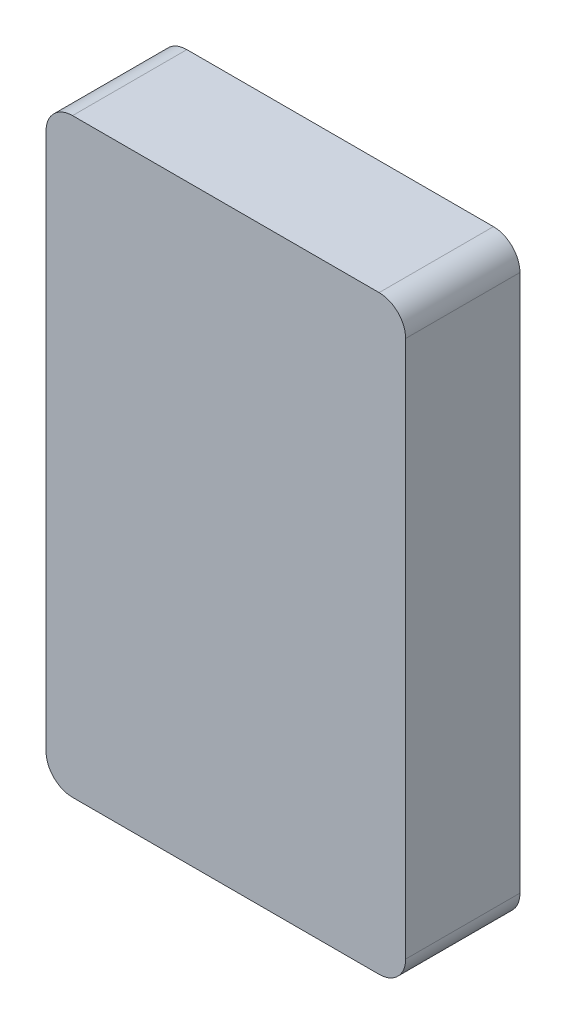
ISO-10303-21;
HEADER;
FILE_DESCRIPTION(('STEP AP214'),'2;1');
FILE_NAME('part.step','',(''),(''),'','','');
FILE_SCHEMA(('AUTOMOTIVE_DESIGN { 1 0 10303 214 1 1 1 1 }'));
ENDSEC;
DATA;
#1=APPLICATION_CONTEXT('core data for automotive mechanical design processes');
#2=APPLICATION_PROTOCOL_DEFINITION('international standard','automotive_design',2000,#1);
#3=PRODUCT_CONTEXT('',#1,'mechanical');
#4=PRODUCT('Part','Part','',(#3));
#5=PRODUCT_RELATED_PRODUCT_CATEGORY('part','',(#4));
#6=PRODUCT_DEFINITION_FORMATION('','',#4);
#7=PRODUCT_DEFINITION_CONTEXT('part definition',#1,'design');
#8=PRODUCT_DEFINITION('design','',#6,#7);
#9=PRODUCT_DEFINITION_SHAPE('','',#8);
#10=(LENGTH_UNIT() NAMED_UNIT(*) SI_UNIT(.MILLI.,.METRE.));
#11=(NAMED_UNIT(*) PLANE_ANGLE_UNIT() SI_UNIT($,.RADIAN.));
#12=(NAMED_UNIT(*) SI_UNIT($,.STERADIAN.) SOLID_ANGLE_UNIT());
#13=UNCERTAINTY_MEASURE_WITH_UNIT(LENGTH_MEASURE(1.E-05),#10,'distance_accuracy_value','');
#14=(GEOMETRIC_REPRESENTATION_CONTEXT(3) GLOBAL_UNCERTAINTY_ASSIGNED_CONTEXT((#13)) GLOBAL_UNIT_ASSIGNED_CONTEXT((#10,
#11,#12)) REPRESENTATION_CONTEXT('',''));
#15=CARTESIAN_POINT('',(0.,0.,0.));
#16=DIRECTION('',(0.,0.,1.));
#17=DIRECTION('',(1.,0.,0.));
#18=AXIS2_PLACEMENT_3D('',#15,#16,#17);
#19=CARTESIAN_POINT('',(-400.,-5.,0.));
#20=DIRECTION('',(0.,0.,1.));
#21=DIRECTION('',(1.,0.,0.));
#22=AXIS2_PLACEMENT_3D('',#19,#20,#21);
#23=PLANE('',#22);
#24=CARTESIAN_POINT('',(-400.,-5.,0.));
#25=DIRECTION('',(0.,0.,1.));
#26=DIRECTION('',(1.,0.,0.));
#27=AXIS2_PLACEMENT_3D('',#24,#25,#26);
#28=CIRCLE('',#27,35.);
#29=CARTESIAN_POINT('',(-435.,-5.00000000000001,0.));
#30=VERTEX_POINT('',#29);
#31=CARTESIAN_POINT('',(-400.,-40.,0.));
#32=VERTEX_POINT('',#31);
#33=EDGE_CURVE('E195',#30,#32,#28,.T.);
#34=ORIENTED_EDGE('',*,*,#33,.F.);
#35=DIRECTION('',(0.,-1.,0.));
#36=VECTOR('',#35,1.);
#37=CARTESIAN_POINT('',(-435.,705.,0.));
#38=LINE('',#37,#36);
#39=CARTESIAN_POINT('',(-435.,705.,0.));
#40=VERTEX_POINT('',#39);
#41=EDGE_CURVE('E55',#40,#30,#38,.T.);
#42=ORIENTED_EDGE('',*,*,#41,.F.);
#43=CARTESIAN_POINT('',(-400.,705.,0.));
#44=DIRECTION('',(0.,0.,1.));
#45=DIRECTION('',(1.,0.,0.));
#46=AXIS2_PLACEMENT_3D('',#43,#44,#45);
#47=CIRCLE('',#46,35.0000000000001);
#48=CARTESIAN_POINT('',(-400.,740.,0.));
#49=VERTEX_POINT('',#48);
#50=EDGE_CURVE('E207',#49,#40,#47,.T.);
#51=ORIENTED_EDGE('',*,*,#50,.F.);
#52=DIRECTION('',(-1.,0.,0.));
#53=VECTOR('',#52,1.);
#54=CARTESIAN_POINT('',(-400.,740.,0.));
#55=LINE('',#54,#53);
#56=CARTESIAN_POINT('',(5.,740.,0.));
#57=VERTEX_POINT('',#56);
#58=EDGE_CURVE('E205',#57,#49,#55,.T.);
#59=ORIENTED_EDGE('',*,*,#58,.F.);
#60=CARTESIAN_POINT('',(5.,705.,0.));
#61=DIRECTION('',(0.,0.,1.));
#62=DIRECTION('',(-1.,0.,0.));
#63=AXIS2_PLACEMENT_3D('',#60,#61,#62);
#64=CIRCLE('',#63,35.0000000000001);
#65=CARTESIAN_POINT('',(40.0000000000001,705.,0.));
#66=VERTEX_POINT('',#65);
#67=EDGE_CURVE('E203',#66,#57,#64,.T.);
#68=ORIENTED_EDGE('',*,*,#67,.F.);
#69=DIRECTION('',(0.,1.,0.));
#70=VECTOR('',#69,1.);
#71=CARTESIAN_POINT('',(40.,705.,0.));
#72=LINE('',#71,#70);
#73=CARTESIAN_POINT('',(40.0000000000001,-5.00000000000005,0.));
#74=VERTEX_POINT('',#73);
#75=EDGE_CURVE('E201',#74,#66,#72,.T.);
#76=ORIENTED_EDGE('',*,*,#75,.F.);
#77=CARTESIAN_POINT('',(5.00000000000012,-5.00000000000005,0.));
#78=DIRECTION('',(0.,0.,1.));
#79=DIRECTION('',(1.,0.,0.));
#80=AXIS2_PLACEMENT_3D('',#77,#78,#79);
#81=CIRCLE('',#80,35.);
#82=CARTESIAN_POINT('',(5.00000000000011,-40.,0.));
#83=VERTEX_POINT('',#82);
#84=EDGE_CURVE('E131',#83,#74,#81,.T.);
#85=ORIENTED_EDGE('',*,*,#84,.F.);
#86=DIRECTION('',(1.,0.,0.));
#87=VECTOR('',#86,1.);
#88=CARTESIAN_POINT('',(-400.,-40.,0.));
#89=LINE('',#88,#87);
#90=EDGE_CURVE('E198',#32,#83,#89,.T.);
#91=ORIENTED_EDGE('',*,*,#90,.F.);
#92=EDGE_LOOP('',(#34,#42,#51,#59,#68,#76,#85,#91));
#93=FACE_BOUND('',#92,.T.);
#94=DIRECTION('',(0.,1.,0.));
#95=VECTOR('',#94,1.);
#96=CARTESIAN_POINT('',(0.,0.,0.));
#97=LINE('',#96,#95);
#98=CARTESIAN_POINT('',(0.,0.,0.));
#99=VERTEX_POINT('',#98);
#100=CARTESIAN_POINT('',(0.,700.,0.));
#101=VERTEX_POINT('',#100);
#102=EDGE_CURVE('E47',#99,#101,#97,.T.);
#103=ORIENTED_EDGE('',*,*,#102,.T.);
#104=DIRECTION('',(-1.,0.,0.));
#105=VECTOR('',#104,1.);
#106=CARTESIAN_POINT('',(0.,700.,0.));
#107=LINE('',#106,#105);
#108=CARTESIAN_POINT('',(-395.,700.,0.));
#109=VERTEX_POINT('',#108);
#110=EDGE_CURVE('E180',#101,#109,#107,.T.);
#111=ORIENTED_EDGE('',*,*,#110,.T.);
#112=DIRECTION('',(0.,-1.,0.));
#113=VECTOR('',#112,1.);
#114=CARTESIAN_POINT('',(-395.,0.,0.));
#115=LINE('',#114,#113);
#116=CARTESIAN_POINT('',(-395.,0.,0.));
#117=VERTEX_POINT('',#116);
#118=EDGE_CURVE('E183',#109,#117,#115,.T.);
#119=ORIENTED_EDGE('',*,*,#118,.T.);
#120=DIRECTION('',(1.,0.,0.));
#121=VECTOR('',#120,1.);
#122=CARTESIAN_POINT('',(0.,0.,0.));
#123=LINE('',#122,#121);
#124=EDGE_CURVE('E169',#117,#99,#123,.T.);
#125=ORIENTED_EDGE('',*,*,#124,.T.);
#126=EDGE_LOOP('',(#103,#111,#119,#125));
#127=FACE_BOUND('',#126,.T.);
#128=ADVANCED_FACE('F32',(#93,#127),#23,.F.);
#129=CARTESIAN_POINT('',(-400.,-5.,150.));
#130=DIRECTION('',(0.,0.,-1.));
#131=DIRECTION('',(-1.,0.,0.));
#132=AXIS2_PLACEMENT_3D('',#129,#130,#131);
#133=CYLINDRICAL_SURFACE('',#132,35.);
#134=ORIENTED_EDGE('',*,*,#33,.T.);
#135=DIRECTION('',(0.,0.,-1.));
#136=VECTOR('',#135,1.);
#137=CARTESIAN_POINT('',(-400.,-40.,150.));
#138=LINE('',#137,#136);
#139=CARTESIAN_POINT('',(-400.,-40.,151.));
#140=VERTEX_POINT('',#139);
#141=EDGE_CURVE('E11',#140,#32,#138,.T.);
#142=ORIENTED_EDGE('',*,*,#141,.F.);
#143=CARTESIAN_POINT('',(-400.,-5.,151.));
#144=DIRECTION('',(0.,0.,1.));
#145=DIRECTION('',(1.,0.,0.));
#146=AXIS2_PLACEMENT_3D('',#143,#144,#145);
#147=CIRCLE('',#146,35.);
#148=CARTESIAN_POINT('',(-435.,-5.,151.));
#149=VERTEX_POINT('',#148);
#150=EDGE_CURVE('E162',#149,#140,#147,.T.);
#151=ORIENTED_EDGE('',*,*,#150,.F.);
#152=DIRECTION('',(0.,0.,-1.));
#153=VECTOR('',#152,1.);
#154=CARTESIAN_POINT('',(-435.,-5.00000000000001,150.));
#155=LINE('',#154,#153);
#156=EDGE_CURVE('E210',#149,#30,#155,.T.);
#157=ORIENTED_EDGE('',*,*,#156,.T.);
#158=EDGE_LOOP('',(#134,#142,#151,#157));
#159=FACE_BOUND('',#158,.T.);
#160=ADVANCED_FACE('F34',(#159),#133,.T.);
#161=CARTESIAN_POINT('',(-400.,-40.,150.));
#162=DIRECTION('',(0.,1.,0.));
#163=DIRECTION('',(-1.,0.,0.));
#164=AXIS2_PLACEMENT_3D('',#161,#162,#163);
#165=PLANE('',#164);
#166=ORIENTED_EDGE('',*,*,#90,.T.);
#167=DIRECTION('',(0.,0.,-1.));
#168=VECTOR('',#167,1.);
#169=CARTESIAN_POINT('',(5.00000000000011,-40.,150.));
#170=LINE('',#169,#168);
#171=CARTESIAN_POINT('',(5.00000000000011,-40.,151.));
#172=VERTEX_POINT('',#171);
#173=EDGE_CURVE('E40',#172,#83,#170,.T.);
#174=ORIENTED_EDGE('',*,*,#173,.F.);
#175=DIRECTION('',(1.,0.,0.));
#176=VECTOR('',#175,1.);
#177=CARTESIAN_POINT('',(-400.,-40.,151.));
#178=LINE('',#177,#176);
#179=EDGE_CURVE('E149',#140,#172,#178,.T.);
#180=ORIENTED_EDGE('',*,*,#179,.F.);
#181=ORIENTED_EDGE('',*,*,#141,.T.);
#182=EDGE_LOOP('',(#166,#174,#180,#181));
#183=FACE_BOUND('',#182,.T.);
#184=ADVANCED_FACE('F239',(#183),#165,.F.);
#185=CARTESIAN_POINT('',(5.00000000000012,-5.00000000000005,150.));
#186=DIRECTION('',(0.,0.,-1.));
#187=DIRECTION('',(-1.,0.,0.));
#188=AXIS2_PLACEMENT_3D('',#185,#186,#187);
#189=CYLINDRICAL_SURFACE('',#188,35.);
#190=ORIENTED_EDGE('',*,*,#84,.T.);
#191=DIRECTION('',(0.,0.,-1.));
#192=VECTOR('',#191,1.);
#193=CARTESIAN_POINT('',(40.0000000000001,-5.00000000000005,150.));
#194=LINE('',#193,#192);
#195=CARTESIAN_POINT('',(40.0000000000001,-5.00000000000005,151.));
#196=VERTEX_POINT('',#195);
#197=EDGE_CURVE('E124',#196,#74,#194,.T.);
#198=ORIENTED_EDGE('',*,*,#197,.F.);
#199=CARTESIAN_POINT('',(5.00000000000012,-5.00000000000005,151.));
#200=DIRECTION('',(0.,0.,1.));
#201=DIRECTION('',(1.,0.,0.));
#202=AXIS2_PLACEMENT_3D('',#199,#200,#201);
#203=CIRCLE('',#202,35.);
#204=EDGE_CURVE('E129',#172,#196,#203,.T.);
#205=ORIENTED_EDGE('',*,*,#204,.F.);
#206=ORIENTED_EDGE('',*,*,#173,.T.);
#207=EDGE_LOOP('',(#190,#198,#205,#206));
#208=FACE_BOUND('',#207,.T.);
#209=ADVANCED_FACE('F126',(#208),#189,.T.);
#210=CARTESIAN_POINT('',(40.,705.,150.));
#211=DIRECTION('',(-1.,0.,0.));
#212=DIRECTION('',(0.,-1.,0.));
#213=AXIS2_PLACEMENT_3D('',#210,#211,#212);
#214=PLANE('',#213);
#215=ORIENTED_EDGE('',*,*,#75,.T.);
#216=DIRECTION('',(0.,0.,-1.));
#217=VECTOR('',#216,1.);
#218=CARTESIAN_POINT('',(40.0000000000001,705.,150.));
#219=LINE('',#218,#217);
#220=CARTESIAN_POINT('',(40.0000000000001,705.,151.));
#221=VERTEX_POINT('',#220);
#222=EDGE_CURVE('E134',#221,#66,#219,.T.);
#223=ORIENTED_EDGE('',*,*,#222,.F.);
#224=DIRECTION('',(0.,1.,0.));
#225=VECTOR('',#224,1.);
#226=CARTESIAN_POINT('',(40.0000000000001,-5.00000000000005,151.));
#227=LINE('',#226,#225);
#228=EDGE_CURVE('E137',#196,#221,#227,.T.);
#229=ORIENTED_EDGE('',*,*,#228,.F.);
#230=ORIENTED_EDGE('',*,*,#197,.T.);
#231=EDGE_LOOP('',(#215,#223,#229,#230));
#232=FACE_BOUND('',#231,.T.);
#233=ADVANCED_FACE('F138',(#232),#214,.F.);
#234=CARTESIAN_POINT('',(5.,705.,150.));
#235=DIRECTION('',(0.,0.,-1.));
#236=DIRECTION('',(-1.,0.,0.));
#237=AXIS2_PLACEMENT_3D('',#234,#235,#236);
#238=CYLINDRICAL_SURFACE('',#237,35.0000000000001);
#239=ORIENTED_EDGE('',*,*,#67,.T.);
#240=DIRECTION('',(0.,0.,-1.));
#241=VECTOR('',#240,1.);
#242=CARTESIAN_POINT('',(5.,740.,150.));
#243=LINE('',#242,#241);
#244=CARTESIAN_POINT('',(5.,740.,151.));
#245=VERTEX_POINT('',#244);
#246=EDGE_CURVE('E217',#245,#57,#243,.T.);
#247=ORIENTED_EDGE('',*,*,#246,.F.);
#248=CARTESIAN_POINT('',(5.,705.,151.));
#249=DIRECTION('',(0.,0.,1.));
#250=DIRECTION('',(1.,0.,0.));
#251=AXIS2_PLACEMENT_3D('',#248,#249,#250);
#252=CIRCLE('',#251,35.0000000000001);
#253=EDGE_CURVE('E143',#221,#245,#252,.T.);
#254=ORIENTED_EDGE('',*,*,#253,.F.);
#255=ORIENTED_EDGE('',*,*,#222,.T.);
#256=EDGE_LOOP('',(#239,#247,#254,#255));
#257=FACE_BOUND('',#256,.T.);
#258=ADVANCED_FACE('F227',(#257),#238,.T.);
#259=CARTESIAN_POINT('',(-400.,740.,150.));
#260=DIRECTION('',(0.,-1.,0.));
#261=DIRECTION('',(0.,0.,-1.));
#262=AXIS2_PLACEMENT_3D('',#259,#260,#261);
#263=PLANE('',#262);
#264=ORIENTED_EDGE('',*,*,#58,.T.);
#265=DIRECTION('',(0.,0.,-1.));
#266=VECTOR('',#265,1.);
#267=CARTESIAN_POINT('',(-400.,740.,150.));
#268=LINE('',#267,#266);
#269=CARTESIAN_POINT('',(-400.,740.,151.));
#270=VERTEX_POINT('',#269);
#271=EDGE_CURVE('E214',#270,#49,#268,.T.);
#272=ORIENTED_EDGE('',*,*,#271,.F.);
#273=DIRECTION('',(-1.,0.,0.));
#274=VECTOR('',#273,1.);
#275=CARTESIAN_POINT('',(5.,740.,151.));
#276=LINE('',#275,#274);
#277=EDGE_CURVE('E153',#245,#270,#276,.T.);
#278=ORIENTED_EDGE('',*,*,#277,.F.);
#279=ORIENTED_EDGE('',*,*,#246,.T.);
#280=EDGE_LOOP('',(#264,#272,#278,#279));
#281=FACE_BOUND('',#280,.T.);
#282=ADVANCED_FACE('F231',(#281),#263,.F.);
#283=CARTESIAN_POINT('',(-400.,705.,150.));
#284=DIRECTION('',(0.,0.,-1.));
#285=DIRECTION('',(-1.,0.,0.));
#286=AXIS2_PLACEMENT_3D('',#283,#284,#285);
#287=CYLINDRICAL_SURFACE('',#286,35.0000000000001);
#288=ORIENTED_EDGE('',*,*,#50,.T.);
#289=DIRECTION('',(0.,0.,-1.));
#290=VECTOR('',#289,1.);
#291=CARTESIAN_POINT('',(-435.,705.,150.));
#292=LINE('',#291,#290);
#293=CARTESIAN_POINT('',(-435.,705.,151.));
#294=VERTEX_POINT('',#293);
#295=EDGE_CURVE('E212',#294,#40,#292,.T.);
#296=ORIENTED_EDGE('',*,*,#295,.F.);
#297=CARTESIAN_POINT('',(-400.,705.,151.));
#298=DIRECTION('',(0.,0.,1.));
#299=DIRECTION('',(1.,0.,0.));
#300=AXIS2_PLACEMENT_3D('',#297,#298,#299);
#301=CIRCLE('',#300,35.);
#302=EDGE_CURVE('E156',#270,#294,#301,.T.);
#303=ORIENTED_EDGE('',*,*,#302,.F.);
#304=ORIENTED_EDGE('',*,*,#271,.T.);
#305=EDGE_LOOP('',(#288,#296,#303,#304));
#306=FACE_BOUND('',#305,.T.);
#307=ADVANCED_FACE('F234',(#306),#287,.T.);
#308=CARTESIAN_POINT('',(-435.,705.,150.));
#309=DIRECTION('',(1.,0.,0.));
#310=DIRECTION('',(0.,1.,0.));
#311=AXIS2_PLACEMENT_3D('',#308,#309,#310);
#312=PLANE('',#311);
#313=ORIENTED_EDGE('',*,*,#41,.T.);
#314=ORIENTED_EDGE('',*,*,#156,.F.);
#315=DIRECTION('',(0.,-1.,0.));
#316=VECTOR('',#315,1.);
#317=CARTESIAN_POINT('',(-435.,705.,151.));
#318=LINE('',#317,#316);
#319=EDGE_CURVE('E159',#294,#149,#318,.T.);
#320=ORIENTED_EDGE('',*,*,#319,.F.);
#321=ORIENTED_EDGE('',*,*,#295,.T.);
#322=EDGE_LOOP('',(#313,#314,#320,#321));
#323=FACE_BOUND('',#322,.T.);
#324=ADVANCED_FACE('F238',(#323),#312,.F.);
#325=CARTESIAN_POINT('',(0.,0.,150.));
#326=DIRECTION('',(-1.,0.,0.));
#327=DIRECTION('',(0.,0.,1.));
#328=AXIS2_PLACEMENT_3D('',#325,#326,#327);
#329=PLANE('',#328);
#330=ORIENTED_EDGE('',*,*,#102,.F.);
#331=DIRECTION('',(0.,0.,-1.));
#332=VECTOR('',#331,1.);
#333=CARTESIAN_POINT('',(0.,0.,150.));
#334=LINE('',#333,#332);
#335=CARTESIAN_POINT('',(0.,0.,150.));
#336=VERTEX_POINT('',#335);
#337=EDGE_CURVE('E178',#336,#99,#334,.T.);
#338=ORIENTED_EDGE('',*,*,#337,.F.);
#339=DIRECTION('',(0.,1.,0.));
#340=VECTOR('',#339,1.);
#341=CARTESIAN_POINT('',(0.,0.,150.));
#342=LINE('',#341,#340);
#343=CARTESIAN_POINT('',(0.,700.,150.));
#344=VERTEX_POINT('',#343);
#345=EDGE_CURVE('E165',#336,#344,#342,.T.);
#346=ORIENTED_EDGE('',*,*,#345,.T.);
#347=DIRECTION('',(0.,0.,-1.));
#348=VECTOR('',#347,1.);
#349=CARTESIAN_POINT('',(0.,700.,150.));
#350=LINE('',#349,#348);
#351=EDGE_CURVE('E193',#344,#101,#350,.T.);
#352=ORIENTED_EDGE('',*,*,#351,.T.);
#353=EDGE_LOOP('',(#330,#338,#346,#352));
#354=FACE_BOUND('',#353,.T.);
#355=ADVANCED_FACE('F252',(#354),#329,.T.);
#356=CARTESIAN_POINT('',(0.,700.,150.));
#357=DIRECTION('',(0.,-1.,0.));
#358=DIRECTION('',(0.,0.,-1.));
#359=AXIS2_PLACEMENT_3D('',#356,#357,#358);
#360=PLANE('',#359);
#361=ORIENTED_EDGE('',*,*,#110,.F.);
#362=ORIENTED_EDGE('',*,*,#351,.F.);
#363=DIRECTION('',(-1.,0.,0.));
#364=VECTOR('',#363,1.);
#365=CARTESIAN_POINT('',(0.,700.,150.));
#366=LINE('',#365,#364);
#367=CARTESIAN_POINT('',(-395.,700.,150.));
#368=VERTEX_POINT('',#367);
#369=EDGE_CURVE('E168',#344,#368,#366,.T.);
#370=ORIENTED_EDGE('',*,*,#369,.T.);
#371=DIRECTION('',(0.,0.,-1.));
#372=VECTOR('',#371,1.);
#373=CARTESIAN_POINT('',(-395.,700.,150.));
#374=LINE('',#373,#372);
#375=EDGE_CURVE('E191',#368,#109,#374,.T.);
#376=ORIENTED_EDGE('',*,*,#375,.T.);
#377=EDGE_LOOP('',(#361,#362,#370,#376));
#378=FACE_BOUND('',#377,.T.);
#379=ADVANCED_FACE('F289',(#378),#360,.T.);
#380=CARTESIAN_POINT('',(-395.,0.,150.));
#381=DIRECTION('',(1.,0.,0.));
#382=DIRECTION('',(0.,0.,-1.));
#383=AXIS2_PLACEMENT_3D('',#380,#381,#382);
#384=PLANE('',#383);
#385=ORIENTED_EDGE('',*,*,#118,.F.);
#386=ORIENTED_EDGE('',*,*,#375,.F.);
#387=DIRECTION('',(0.,-1.,0.));
#388=VECTOR('',#387,1.);
#389=CARTESIAN_POINT('',(-395.,0.,150.));
#390=LINE('',#389,#388);
#391=CARTESIAN_POINT('',(-395.,0.,150.));
#392=VERTEX_POINT('',#391);
#393=EDGE_CURVE('E172',#368,#392,#390,.T.);
#394=ORIENTED_EDGE('',*,*,#393,.T.);
#395=DIRECTION('',(0.,0.,-1.));
#396=VECTOR('',#395,1.);
#397=CARTESIAN_POINT('',(-395.,0.,150.));
#398=LINE('',#397,#396);
#399=EDGE_CURVE('E189',#392,#117,#398,.T.);
#400=ORIENTED_EDGE('',*,*,#399,.T.);
#401=EDGE_LOOP('',(#385,#386,#394,#400));
#402=FACE_BOUND('',#401,.T.);
#403=ADVANCED_FACE('F295',(#402),#384,.T.);
#404=CARTESIAN_POINT('',(0.,0.,150.));
#405=DIRECTION('',(0.,1.,0.));
#406=DIRECTION('',(0.,0.,1.));
#407=AXIS2_PLACEMENT_3D('',#404,#405,#406);
#408=PLANE('',#407);
#409=ORIENTED_EDGE('',*,*,#124,.F.);
#410=ORIENTED_EDGE('',*,*,#399,.F.);
#411=DIRECTION('',(1.,0.,0.));
#412=VECTOR('',#411,1.);
#413=CARTESIAN_POINT('',(0.,0.,150.));
#414=LINE('',#413,#412);
#415=EDGE_CURVE('E175',#392,#336,#414,.T.);
#416=ORIENTED_EDGE('',*,*,#415,.T.);
#417=ORIENTED_EDGE('',*,*,#337,.T.);
#418=EDGE_LOOP('',(#409,#410,#416,#417));
#419=FACE_BOUND('',#418,.T.);
#420=ADVANCED_FACE('F302',(#419),#408,.T.);
#421=CARTESIAN_POINT('',(5.00000000000012,-5.00000000000005,150.));
#422=DIRECTION('',(0.,0.,1.));
#423=DIRECTION('',(1.,0.,0.));
#424=AXIS2_PLACEMENT_3D('',#421,#422,#423);
#425=PLANE('',#424);
#426=ORIENTED_EDGE('',*,*,#345,.F.);
#427=ORIENTED_EDGE('',*,*,#415,.F.);
#428=ORIENTED_EDGE('',*,*,#393,.F.);
#429=ORIENTED_EDGE('',*,*,#369,.F.);
#430=EDGE_LOOP('',(#426,#427,#428,#429));
#431=FACE_BOUND('',#430,.T.);
#432=ADVANCED_FACE('F310',(#431),#425,.F.);
#433=CARTESIAN_POINT('',(5.00000000000012,-5.00000000000005,151.));
#434=DIRECTION('',(0.,0.,1.));
#435=DIRECTION('',(1.,0.,0.));
#436=AXIS2_PLACEMENT_3D('',#433,#434,#435);
#437=PLANE('',#436);
#438=ORIENTED_EDGE('',*,*,#204,.T.);
#439=ORIENTED_EDGE('',*,*,#228,.T.);
#440=ORIENTED_EDGE('',*,*,#253,.T.);
#441=ORIENTED_EDGE('',*,*,#277,.T.);
#442=ORIENTED_EDGE('',*,*,#302,.T.);
#443=ORIENTED_EDGE('',*,*,#319,.T.);
#444=ORIENTED_EDGE('',*,*,#150,.T.);
#445=ORIENTED_EDGE('',*,*,#179,.T.);
#446=EDGE_LOOP('',(#438,#439,#440,#441,#442,#443,#444,#445));
#447=FACE_BOUND('',#446,.T.);
#448=ADVANCED_FACE('F146',(#447),#437,.T.);
#449=CLOSED_SHELL('',(#128,#160,#184,#209,#233,#258,#282,#307,#324,#355,#379,#403,#420,#432,#448));
#450=MANIFOLD_SOLID_BREP('B2',#449);
#451=ADVANCED_BREP_SHAPE_REPRESENTATION('',(#18,#450),#14);
#452=SHAPE_DEFINITION_REPRESENTATION(#9,#451);
ENDSEC;
END-ISO-10303-21;
